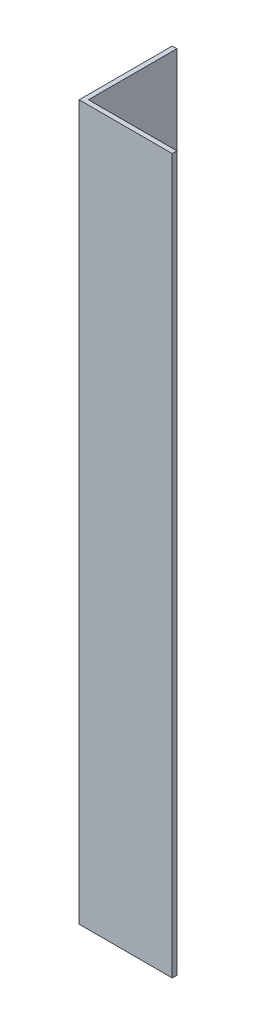
ISO-10303-21;
HEADER;
FILE_DESCRIPTION(('STEP AP214'),'2;1');
FILE_NAME('part.step','',(''),(''),'','','');
FILE_SCHEMA(('AUTOMOTIVE_DESIGN { 1 0 10303 214 1 1 1 1 }'));
ENDSEC;
DATA;
#1=APPLICATION_CONTEXT('core data for automotive mechanical design processes');
#2=APPLICATION_PROTOCOL_DEFINITION('international standard','automotive_design',2000,#1);
#3=PRODUCT_CONTEXT('',#1,'mechanical');
#4=PRODUCT('Part','Part','',(#3));
#5=PRODUCT_RELATED_PRODUCT_CATEGORY('part','',(#4));
#6=PRODUCT_DEFINITION_FORMATION('','',#4);
#7=PRODUCT_DEFINITION_CONTEXT('part definition',#1,'design');
#8=PRODUCT_DEFINITION('design','',#6,#7);
#9=PRODUCT_DEFINITION_SHAPE('','',#8);
#10=(LENGTH_UNIT() NAMED_UNIT(*) SI_UNIT(.MILLI.,.METRE.));
#11=(NAMED_UNIT(*) PLANE_ANGLE_UNIT() SI_UNIT($,.RADIAN.));
#12=(NAMED_UNIT(*) SI_UNIT($,.STERADIAN.) SOLID_ANGLE_UNIT());
#13=UNCERTAINTY_MEASURE_WITH_UNIT(LENGTH_MEASURE(1.E-05),#10,'distance_accuracy_value','');
#14=(GEOMETRIC_REPRESENTATION_CONTEXT(3) GLOBAL_UNCERTAINTY_ASSIGNED_CONTEXT((#13)) GLOBAL_UNIT_ASSIGNED_CONTEXT((#10,
#11,#12)) REPRESENTATION_CONTEXT('',''));
#15=CARTESIAN_POINT('',(0.,0.,0.));
#16=DIRECTION('',(0.,0.,1.));
#17=DIRECTION('',(1.,0.,0.));
#18=AXIS2_PLACEMENT_3D('',#15,#16,#17);
#19=CARTESIAN_POINT('',(15.,115.,0.));
#20=DIRECTION('',(0.,0.,-1.));
#21=DIRECTION('',(-1.,0.,0.));
#22=AXIS2_PLACEMENT_3D('',#19,#20,#21);
#23=PLANE('',#22);
#24=DIRECTION('',(1.,0.,0.));
#25=VECTOR('',#24,1.);
#26=CARTESIAN_POINT('',(15.,0.,0.));
#27=LINE('',#26,#25);
#28=CARTESIAN_POINT('',(0.,0.,0.));
#29=VERTEX_POINT('',#28);
#30=CARTESIAN_POINT('',(15.,0.,0.));
#31=VERTEX_POINT('',#30);
#32=EDGE_CURVE('E118',#29,#31,#27,.T.);
#33=ORIENTED_EDGE('',*,*,#32,.T.);
#34=DIRECTION('',(0.,-1.,0.));
#35=VECTOR('',#34,1.);
#36=CARTESIAN_POINT('',(15.,115.,0.));
#37=LINE('',#36,#35);
#38=CARTESIAN_POINT('',(15.,115.,0.));
#39=VERTEX_POINT('',#38);
#40=EDGE_CURVE('E11',#39,#31,#37,.T.);
#41=ORIENTED_EDGE('',*,*,#40,.F.);
#42=DIRECTION('',(1.,0.,0.));
#43=VECTOR('',#42,1.);
#44=CARTESIAN_POINT('',(15.,115.,0.));
#45=LINE('',#44,#43);
#46=CARTESIAN_POINT('',(0.,115.,0.));
#47=VERTEX_POINT('',#46);
#48=EDGE_CURVE('E128',#47,#39,#45,.T.);
#49=ORIENTED_EDGE('',*,*,#48,.F.);
#50=DIRECTION('',(0.,-1.,0.));
#51=VECTOR('',#50,1.);
#52=CARTESIAN_POINT('',(0.,115.,0.));
#53=LINE('',#52,#51);
#54=EDGE_CURVE('E114',#47,#29,#53,.T.);
#55=ORIENTED_EDGE('',*,*,#54,.T.);
#56=EDGE_LOOP('',(#33,#41,#49,#55));
#57=FACE_BOUND('',#56,.T.);
#58=ADVANCED_FACE('F34',(#57),#23,.F.);
#59=CARTESIAN_POINT('',(15.,115.,-0.749999999999998));
#60=DIRECTION('',(-1.,0.,0.));
#61=DIRECTION('',(0.,0.,1.));
#62=AXIS2_PLACEMENT_3D('',#59,#60,#61);
#63=PLANE('',#62);
#64=DIRECTION('',(0.,0.,-1.));
#65=VECTOR('',#64,1.);
#66=CARTESIAN_POINT('',(15.,0.,-0.749999999999998));
#67=LINE('',#66,#65);
#68=CARTESIAN_POINT('',(15.,0.,-0.749999999999998));
#69=VERTEX_POINT('',#68);
#70=EDGE_CURVE('E121',#31,#69,#67,.T.);
#71=ORIENTED_EDGE('',*,*,#70,.T.);
#72=DIRECTION('',(0.,-1.,0.));
#73=VECTOR('',#72,1.);
#74=CARTESIAN_POINT('',(15.,115.,-0.749999999999998));
#75=LINE('',#74,#73);
#76=CARTESIAN_POINT('',(15.,115.,-0.749999999999998));
#77=VERTEX_POINT('',#76);
#78=EDGE_CURVE('E42',#77,#69,#75,.T.);
#79=ORIENTED_EDGE('',*,*,#78,.F.);
#80=DIRECTION('',(0.,0.,-1.));
#81=VECTOR('',#80,1.);
#82=CARTESIAN_POINT('',(15.,115.,-0.749999999999998));
#83=LINE('',#82,#81);
#84=EDGE_CURVE('E87',#39,#77,#83,.T.);
#85=ORIENTED_EDGE('',*,*,#84,.F.);
#86=ORIENTED_EDGE('',*,*,#40,.T.);
#87=EDGE_LOOP('',(#71,#79,#85,#86));
#88=FACE_BOUND('',#87,.T.);
#89=ADVANCED_FACE('F152',(#88),#63,.F.);
#90=CARTESIAN_POINT('',(0.749999999999998,115.,-0.749999999999998));
#91=DIRECTION('',(0.,0.,1.));
#92=DIRECTION('',(1.,0.,0.));
#93=AXIS2_PLACEMENT_3D('',#90,#91,#92);
#94=PLANE('',#93);
#95=DIRECTION('',(-1.,0.,0.));
#96=VECTOR('',#95,1.);
#97=CARTESIAN_POINT('',(0.749999999999998,0.,-0.749999999999998));
#98=LINE('',#97,#96);
#99=CARTESIAN_POINT('',(0.749999999999998,0.,-0.749999999999998));
#100=VERTEX_POINT('',#99);
#101=EDGE_CURVE('E123',#69,#100,#98,.T.);
#102=ORIENTED_EDGE('',*,*,#101,.T.);
#103=DIRECTION('',(0.,-1.,0.));
#104=VECTOR('',#103,1.);
#105=CARTESIAN_POINT('',(0.749999999999998,115.,-0.749999999999998));
#106=LINE('',#105,#104);
#107=CARTESIAN_POINT('',(0.749999999999998,115.,-0.749999999999998));
#108=VERTEX_POINT('',#107);
#109=EDGE_CURVE('E109',#108,#100,#106,.T.);
#110=ORIENTED_EDGE('',*,*,#109,.F.);
#111=DIRECTION('',(-1.,0.,0.));
#112=VECTOR('',#111,1.);
#113=CARTESIAN_POINT('',(0.749999999999998,115.,-0.749999999999998));
#114=LINE('',#113,#112);
#115=EDGE_CURVE('E100',#77,#108,#114,.T.);
#116=ORIENTED_EDGE('',*,*,#115,.F.);
#117=ORIENTED_EDGE('',*,*,#78,.T.);
#118=EDGE_LOOP('',(#102,#110,#116,#117));
#119=FACE_BOUND('',#118,.T.);
#120=ADVANCED_FACE('F134',(#119),#94,.F.);
#121=CARTESIAN_POINT('',(0.749999999999998,115.,-15.));
#122=DIRECTION('',(-1.,0.,0.));
#123=DIRECTION('',(0.,0.,1.));
#124=AXIS2_PLACEMENT_3D('',#121,#122,#123);
#125=PLANE('',#124);
#126=DIRECTION('',(0.,0.,-1.));
#127=VECTOR('',#126,1.);
#128=CARTESIAN_POINT('',(0.749999999999998,0.,-15.));
#129=LINE('',#128,#127);
#130=CARTESIAN_POINT('',(0.749999999999998,0.,-15.));
#131=VERTEX_POINT('',#130);
#132=EDGE_CURVE('E108',#100,#131,#129,.T.);
#133=ORIENTED_EDGE('',*,*,#132,.T.);
#134=DIRECTION('',(0.,-1.,0.));
#135=VECTOR('',#134,1.);
#136=CARTESIAN_POINT('',(0.749999999999998,115.,-15.));
#137=LINE('',#136,#135);
#138=CARTESIAN_POINT('',(0.749999999999998,115.,-15.));
#139=VERTEX_POINT('',#138);
#140=EDGE_CURVE('E105',#139,#131,#137,.T.);
#141=ORIENTED_EDGE('',*,*,#140,.F.);
#142=DIRECTION('',(0.,0.,-1.));
#143=VECTOR('',#142,1.);
#144=CARTESIAN_POINT('',(0.749999999999998,115.,-15.));
#145=LINE('',#144,#143);
#146=EDGE_CURVE('E94',#108,#139,#145,.T.);
#147=ORIENTED_EDGE('',*,*,#146,.F.);
#148=ORIENTED_EDGE('',*,*,#109,.T.);
#149=EDGE_LOOP('',(#133,#141,#147,#148));
#150=FACE_BOUND('',#149,.T.);
#151=ADVANCED_FACE('F106',(#150),#125,.F.);
#152=CARTESIAN_POINT('',(0.,115.,-15.));
#153=DIRECTION('',(0.,0.,1.));
#154=DIRECTION('',(1.,0.,0.));
#155=AXIS2_PLACEMENT_3D('',#152,#153,#154);
#156=PLANE('',#155);
#157=DIRECTION('',(-1.,0.,0.));
#158=VECTOR('',#157,1.);
#159=CARTESIAN_POINT('',(0.,0.,-15.));
#160=LINE('',#159,#158);
#161=CARTESIAN_POINT('',(0.,0.,-15.));
#162=VERTEX_POINT('',#161);
#163=EDGE_CURVE('E73',#131,#162,#160,.T.);
#164=ORIENTED_EDGE('',*,*,#163,.T.);
#165=DIRECTION('',(0.,-1.,0.));
#166=VECTOR('',#165,1.);
#167=CARTESIAN_POINT('',(0.,115.,-15.));
#168=LINE('',#167,#166);
#169=CARTESIAN_POINT('',(0.,115.,-15.));
#170=VERTEX_POINT('',#169);
#171=EDGE_CURVE('E110',#170,#162,#168,.T.);
#172=ORIENTED_EDGE('',*,*,#171,.F.);
#173=DIRECTION('',(-1.,0.,0.));
#174=VECTOR('',#173,1.);
#175=CARTESIAN_POINT('',(0.,115.,-15.));
#176=LINE('',#175,#174);
#177=EDGE_CURVE('E98',#139,#170,#176,.T.);
#178=ORIENTED_EDGE('',*,*,#177,.F.);
#179=ORIENTED_EDGE('',*,*,#140,.T.);
#180=EDGE_LOOP('',(#164,#172,#178,#179));
#181=FACE_BOUND('',#180,.T.);
#182=ADVANCED_FACE('F112',(#181),#156,.F.);
#183=CARTESIAN_POINT('',(0.,115.,0.));
#184=DIRECTION('',(1.,0.,0.));
#185=DIRECTION('',(0.,0.,-1.));
#186=AXIS2_PLACEMENT_3D('',#183,#184,#185);
#187=PLANE('',#186);
#188=DIRECTION('',(0.,0.,1.));
#189=VECTOR('',#188,1.);
#190=CARTESIAN_POINT('',(0.,0.,0.));
#191=LINE('',#190,#189);
#192=EDGE_CURVE('E79',#162,#29,#191,.T.);
#193=ORIENTED_EDGE('',*,*,#192,.T.);
#194=ORIENTED_EDGE('',*,*,#54,.F.);
#195=DIRECTION('',(0.,0.,1.));
#196=VECTOR('',#195,1.);
#197=CARTESIAN_POINT('',(0.,115.,0.));
#198=LINE('',#197,#196);
#199=EDGE_CURVE('E50',#170,#47,#198,.T.);
#200=ORIENTED_EDGE('',*,*,#199,.F.);
#201=ORIENTED_EDGE('',*,*,#171,.T.);
#202=EDGE_LOOP('',(#193,#194,#200,#201));
#203=FACE_BOUND('',#202,.T.);
#204=ADVANCED_FACE('F141',(#203),#187,.F.);
#205=CARTESIAN_POINT('',(0.,115.,0.));
#206=DIRECTION('',(0.,-1.,0.));
#207=DIRECTION('',(0.,0.,-1.));
#208=AXIS2_PLACEMENT_3D('',#205,#206,#207);
#209=PLANE('',#208);
#210=ORIENTED_EDGE('',*,*,#48,.T.);
#211=ORIENTED_EDGE('',*,*,#84,.T.);
#212=ORIENTED_EDGE('',*,*,#115,.T.);
#213=ORIENTED_EDGE('',*,*,#146,.T.);
#214=ORIENTED_EDGE('',*,*,#177,.T.);
#215=ORIENTED_EDGE('',*,*,#199,.T.);
#216=EDGE_LOOP('',(#210,#211,#212,#213,#214,#215));
#217=FACE_BOUND('',#216,.T.);
#218=ADVANCED_FACE('F96',(#217),#209,.F.);
#219=CARTESIAN_POINT('',(0.,0.,0.));
#220=DIRECTION('',(0.,-1.,0.));
#221=DIRECTION('',(0.,0.,-1.));
#222=AXIS2_PLACEMENT_3D('',#219,#220,#221);
#223=PLANE('',#222);
#224=ORIENTED_EDGE('',*,*,#32,.F.);
#225=ORIENTED_EDGE('',*,*,#192,.F.);
#226=ORIENTED_EDGE('',*,*,#163,.F.);
#227=ORIENTED_EDGE('',*,*,#132,.F.);
#228=ORIENTED_EDGE('',*,*,#101,.F.);
#229=ORIENTED_EDGE('',*,*,#70,.F.);
#230=EDGE_LOOP('',(#224,#225,#226,#227,#228,#229));
#231=FACE_BOUND('',#230,.T.);
#232=ADVANCED_FACE('F137',(#231),#223,.T.);
#233=CLOSED_SHELL('',(#58,#89,#120,#151,#182,#204,#218,#232));
#234=MANIFOLD_SOLID_BREP('B2',#233);
#235=ADVANCED_BREP_SHAPE_REPRESENTATION('',(#18,#234),#14);
#236=SHAPE_DEFINITION_REPRESENTATION(#9,#235);
ENDSEC;
END-ISO-10303-21;
